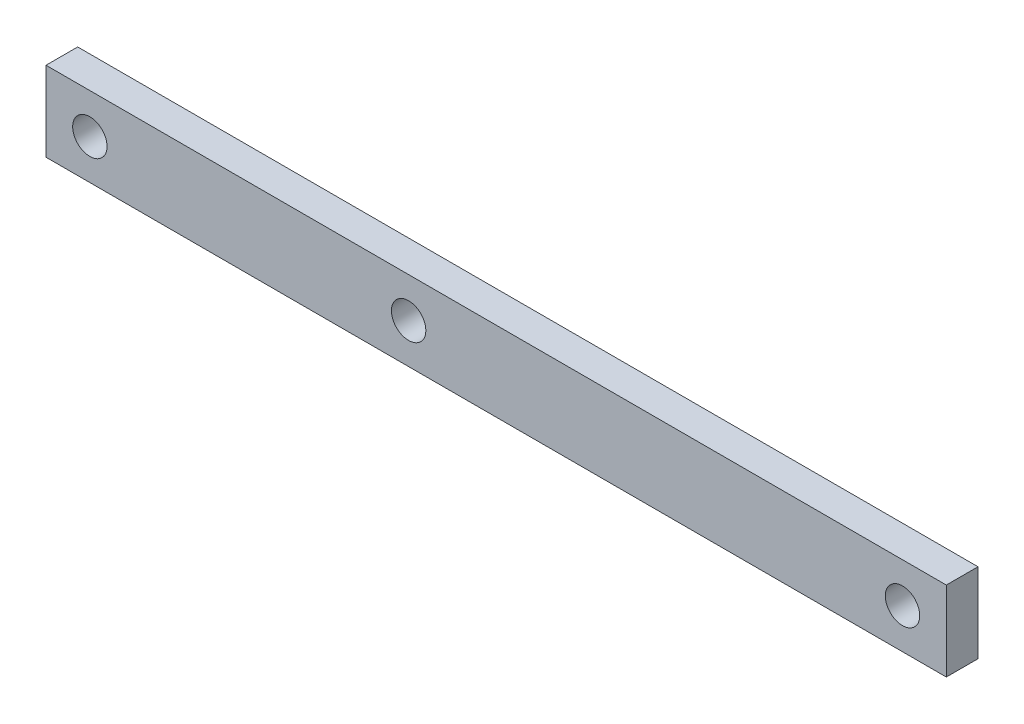
ISO-10303-21;
HEADER;
FILE_DESCRIPTION(('STEP AP214'),'2;1');
FILE_NAME('part.step','',(''),(''),'','','');
FILE_SCHEMA(('AUTOMOTIVE_DESIGN { 1 0 10303 214 1 1 1 1 }'));
ENDSEC;
DATA;
#1=APPLICATION_CONTEXT('core data for automotive mechanical design processes');
#2=APPLICATION_PROTOCOL_DEFINITION('international standard','automotive_design',2000,#1);
#3=PRODUCT_CONTEXT('',#1,'mechanical');
#4=PRODUCT('Part','Part','',(#3));
#5=PRODUCT_RELATED_PRODUCT_CATEGORY('part','',(#4));
#6=PRODUCT_DEFINITION_FORMATION('','',#4);
#7=PRODUCT_DEFINITION_CONTEXT('part definition',#1,'design');
#8=PRODUCT_DEFINITION('design','',#6,#7);
#9=PRODUCT_DEFINITION_SHAPE('','',#8);
#10=(LENGTH_UNIT() NAMED_UNIT(*) SI_UNIT(.MILLI.,.METRE.));
#11=(NAMED_UNIT(*) PLANE_ANGLE_UNIT() SI_UNIT($,.RADIAN.));
#12=(NAMED_UNIT(*) SI_UNIT($,.STERADIAN.) SOLID_ANGLE_UNIT());
#13=UNCERTAINTY_MEASURE_WITH_UNIT(LENGTH_MEASURE(1.E-05),#10,'distance_accuracy_value','');
#14=(GEOMETRIC_REPRESENTATION_CONTEXT(3) GLOBAL_UNCERTAINTY_ASSIGNED_CONTEXT((#13)) GLOBAL_UNIT_ASSIGNED_CONTEXT((#10,
#11,#12)) REPRESENTATION_CONTEXT('',''));
#15=CARTESIAN_POINT('',(0.,0.,0.));
#16=DIRECTION('',(0.,0.,1.));
#17=DIRECTION('',(1.,0.,0.));
#18=AXIS2_PLACEMENT_3D('',#15,#16,#17);
#19=CARTESIAN_POINT('',(0.,0.,3.18));
#20=DIRECTION('',(0.,1.,0.));
#21=DIRECTION('',(0.,0.,1.));
#22=AXIS2_PLACEMENT_3D('',#19,#20,#21);
#23=PLANE('',#22);
#24=DIRECTION('',(1.,0.,0.));
#25=VECTOR('',#24,1.);
#26=CARTESIAN_POINT('',(0.,0.,0.));
#27=LINE('',#26,#25);
#28=CARTESIAN_POINT('',(0.,0.,0.));
#29=VERTEX_POINT('',#28);
#30=CARTESIAN_POINT('',(90.38,0.,0.));
#31=VERTEX_POINT('',#30);
#32=EDGE_CURVE('E98',#29,#31,#27,.T.);
#33=ORIENTED_EDGE('',*,*,#32,.T.);
#34=DIRECTION('',(0.,0.,-1.));
#35=VECTOR('',#34,1.);
#36=CARTESIAN_POINT('',(90.38,0.,3.18));
#37=LINE('',#36,#35);
#38=CARTESIAN_POINT('',(90.38,0.,3.18));
#39=VERTEX_POINT('',#38);
#40=EDGE_CURVE('E11',#39,#31,#37,.T.);
#41=ORIENTED_EDGE('',*,*,#40,.F.);
#42=DIRECTION('',(1.,0.,0.));
#43=VECTOR('',#42,1.);
#44=CARTESIAN_POINT('',(0.,0.,3.18));
#45=LINE('',#44,#43);
#46=CARTESIAN_POINT('',(0.,0.,3.18));
#47=VERTEX_POINT('',#46);
#48=EDGE_CURVE('E84',#47,#39,#45,.T.);
#49=ORIENTED_EDGE('',*,*,#48,.F.);
#50=DIRECTION('',(0.,0.,-1.));
#51=VECTOR('',#50,1.);
#52=CARTESIAN_POINT('',(0.,0.,3.18));
#53=LINE('',#52,#51);
#54=EDGE_CURVE('E51',#47,#29,#53,.T.);
#55=ORIENTED_EDGE('',*,*,#54,.T.);
#56=EDGE_LOOP('',(#33,#41,#49,#55));
#57=FACE_BOUND('',#56,.T.);
#58=ADVANCED_FACE('F35',(#57),#23,.F.);
#59=CARTESIAN_POINT('',(90.38,0.,3.18));
#60=DIRECTION('',(-1.,0.,0.));
#61=DIRECTION('',(0.,0.,1.));
#62=AXIS2_PLACEMENT_3D('',#59,#60,#61);
#63=PLANE('',#62);
#64=DIRECTION('',(0.,1.,0.));
#65=VECTOR('',#64,1.);
#66=CARTESIAN_POINT('',(90.38,0.,0.));
#67=LINE('',#66,#65);
#68=CARTESIAN_POINT('',(90.38,8.,0.));
#69=VERTEX_POINT('',#68);
#70=EDGE_CURVE('E89',#31,#69,#67,.T.);
#71=ORIENTED_EDGE('',*,*,#70,.T.);
#72=DIRECTION('',(0.,0.,-1.));
#73=VECTOR('',#72,1.);
#74=CARTESIAN_POINT('',(90.38,8.,3.18));
#75=LINE('',#74,#73);
#76=CARTESIAN_POINT('',(90.38,8.,3.18));
#77=VERTEX_POINT('',#76);
#78=EDGE_CURVE('E43',#77,#69,#75,.T.);
#79=ORIENTED_EDGE('',*,*,#78,.F.);
#80=DIRECTION('',(0.,1.,0.));
#81=VECTOR('',#80,1.);
#82=CARTESIAN_POINT('',(90.38,0.,3.18));
#83=LINE('',#82,#81);
#84=EDGE_CURVE('E76',#39,#77,#83,.T.);
#85=ORIENTED_EDGE('',*,*,#84,.F.);
#86=ORIENTED_EDGE('',*,*,#40,.T.);
#87=EDGE_LOOP('',(#71,#79,#85,#86));
#88=FACE_BOUND('',#87,.T.);
#89=ADVANCED_FACE('F88',(#88),#63,.F.);
#90=CARTESIAN_POINT('',(0.,8.,3.18));
#91=DIRECTION('',(0.,1.,0.));
#92=DIRECTION('',(0.,0.,1.));
#93=AXIS2_PLACEMENT_3D('',#90,#91,#92);
#94=PLANE('',#93);
#95=DIRECTION('',(1.,0.,0.));
#96=VECTOR('',#95,1.);
#97=CARTESIAN_POINT('',(0.,8.,0.));
#98=LINE('',#97,#96);
#99=CARTESIAN_POINT('',(0.,8.,0.));
#100=VERTEX_POINT('',#99);
#101=EDGE_CURVE('E102',#100,#69,#98,.T.);
#102=ORIENTED_EDGE('',*,*,#101,.F.);
#103=DIRECTION('',(0.,0.,-1.));
#104=VECTOR('',#103,1.);
#105=CARTESIAN_POINT('',(0.,8.,3.18));
#106=LINE('',#105,#104);
#107=CARTESIAN_POINT('',(0.,8.,3.18));
#108=VERTEX_POINT('',#107);
#109=EDGE_CURVE('E65',#108,#100,#106,.T.);
#110=ORIENTED_EDGE('',*,*,#109,.F.);
#111=DIRECTION('',(1.,0.,0.));
#112=VECTOR('',#111,1.);
#113=CARTESIAN_POINT('',(0.,8.,3.18));
#114=LINE('',#113,#112);
#115=EDGE_CURVE('E83',#108,#77,#114,.T.);
#116=ORIENTED_EDGE('',*,*,#115,.T.);
#117=ORIENTED_EDGE('',*,*,#78,.T.);
#118=EDGE_LOOP('',(#102,#110,#116,#117));
#119=FACE_BOUND('',#118,.T.);
#120=ADVANCED_FACE('F92',(#119),#94,.T.);
#121=CARTESIAN_POINT('',(0.,0.,3.18));
#122=DIRECTION('',(-1.,0.,0.));
#123=DIRECTION('',(0.,0.,1.));
#124=AXIS2_PLACEMENT_3D('',#121,#122,#123);
#125=PLANE('',#124);
#126=DIRECTION('',(0.,1.,0.));
#127=VECTOR('',#126,1.);
#128=CARTESIAN_POINT('',(0.,0.,0.));
#129=LINE('',#128,#127);
#130=EDGE_CURVE('E104',#29,#100,#129,.T.);
#131=ORIENTED_EDGE('',*,*,#130,.F.);
#132=ORIENTED_EDGE('',*,*,#54,.F.);
#133=DIRECTION('',(0.,1.,0.));
#134=VECTOR('',#133,1.);
#135=CARTESIAN_POINT('',(0.,0.,3.18));
#136=LINE('',#135,#134);
#137=EDGE_CURVE('E93',#47,#108,#136,.T.);
#138=ORIENTED_EDGE('',*,*,#137,.T.);
#139=ORIENTED_EDGE('',*,*,#109,.T.);
#140=EDGE_LOOP('',(#131,#132,#138,#139));
#141=FACE_BOUND('',#140,.T.);
#142=ADVANCED_FACE('F140',(#141),#125,.T.);
#143=CARTESIAN_POINT('',(0.,0.,3.18));
#144=DIRECTION('',(0.,0.,1.));
#145=DIRECTION('',(1.,0.,0.));
#146=AXIS2_PLACEMENT_3D('',#143,#144,#145);
#147=PLANE('',#146);
#148=CARTESIAN_POINT('',(85.9823578164669,4.,3.18));
#149=DIRECTION('',(0.,0.,1.));
#150=DIRECTION('',(1.,0.,0.));
#151=AXIS2_PLACEMENT_3D('',#148,#149,#150);
#152=CIRCLE('',#151,1.7272);
#153=CARTESIAN_POINT('',(87.7095578164669,4.,3.18));
#154=VERTEX_POINT('',#153);
#155=EDGE_CURVE('E122',#154,#154,#152,.T.);
#156=ORIENTED_EDGE('',*,*,#155,.F.);
#157=EDGE_LOOP('',(#156));
#158=FACE_BOUND('',#157,.T.);
#159=CARTESIAN_POINT('',(36.4023578164669,4.,3.18));
#160=DIRECTION('',(0.,0.,1.));
#161=DIRECTION('',(1.,0.,0.));
#162=AXIS2_PLACEMENT_3D('',#159,#160,#161);
#163=CIRCLE('',#162,1.7272);
#164=CARTESIAN_POINT('',(38.1295578164669,4.,3.18));
#165=VERTEX_POINT('',#164);
#166=EDGE_CURVE('E116',#165,#165,#163,.T.);
#167=ORIENTED_EDGE('',*,*,#166,.F.);
#168=EDGE_LOOP('',(#167));
#169=FACE_BOUND('',#168,.T.);
#170=CARTESIAN_POINT('',(4.40235781646692,4.,3.18));
#171=DIRECTION('',(0.,0.,1.));
#172=DIRECTION('',(1.,0.,0.));
#173=AXIS2_PLACEMENT_3D('',#170,#171,#172);
#174=CIRCLE('',#173,1.7272);
#175=CARTESIAN_POINT('',(6.12955781646692,4.,3.18));
#176=VERTEX_POINT('',#175);
#177=EDGE_CURVE('E110',#176,#176,#174,.T.);
#178=ORIENTED_EDGE('',*,*,#177,.F.);
#179=EDGE_LOOP('',(#178));
#180=FACE_BOUND('',#179,.T.);
#181=ORIENTED_EDGE('',*,*,#48,.T.);
#182=ORIENTED_EDGE('',*,*,#84,.T.);
#183=ORIENTED_EDGE('',*,*,#115,.F.);
#184=ORIENTED_EDGE('',*,*,#137,.F.);
#185=EDGE_LOOP('',(#181,#182,#183,#184));
#186=FACE_BOUND('',#185,.T.);
#187=ADVANCED_FACE('F80',(#158,#169,#180,#186),#147,.T.);
#188=CARTESIAN_POINT('',(0.,0.,0.));
#189=DIRECTION('',(0.,0.,1.));
#190=DIRECTION('',(1.,0.,0.));
#191=AXIS2_PLACEMENT_3D('',#188,#189,#190);
#192=PLANE('',#191);
#193=CARTESIAN_POINT('',(85.9823578164669,4.,0.));
#194=DIRECTION('',(0.,0.,1.));
#195=DIRECTION('',(1.,0.,0.));
#196=AXIS2_PLACEMENT_3D('',#193,#194,#195);
#197=CIRCLE('',#196,1.7272);
#198=CARTESIAN_POINT('',(87.7095578164669,4.,0.));
#199=VERTEX_POINT('',#198);
#200=EDGE_CURVE('E119',#199,#199,#197,.T.);
#201=ORIENTED_EDGE('',*,*,#200,.T.);
#202=EDGE_LOOP('',(#201));
#203=FACE_BOUND('',#202,.T.);
#204=CARTESIAN_POINT('',(36.4023578164669,4.,0.));
#205=DIRECTION('',(0.,0.,1.));
#206=DIRECTION('',(1.,0.,0.));
#207=AXIS2_PLACEMENT_3D('',#204,#205,#206);
#208=CIRCLE('',#207,1.7272);
#209=CARTESIAN_POINT('',(38.1295578164669,4.,0.));
#210=VERTEX_POINT('',#209);
#211=EDGE_CURVE('E113',#210,#210,#208,.T.);
#212=ORIENTED_EDGE('',*,*,#211,.T.);
#213=EDGE_LOOP('',(#212));
#214=FACE_BOUND('',#213,.T.);
#215=CARTESIAN_POINT('',(4.40235781646692,4.,0.));
#216=DIRECTION('',(0.,0.,1.));
#217=DIRECTION('',(1.,0.,0.));
#218=AXIS2_PLACEMENT_3D('',#215,#216,#217);
#219=CIRCLE('',#218,1.7272);
#220=CARTESIAN_POINT('',(6.12955781646692,4.,0.));
#221=VERTEX_POINT('',#220);
#222=EDGE_CURVE('E100',#221,#221,#219,.T.);
#223=ORIENTED_EDGE('',*,*,#222,.T.);
#224=EDGE_LOOP('',(#223));
#225=FACE_BOUND('',#224,.T.);
#226=ORIENTED_EDGE('',*,*,#32,.F.);
#227=ORIENTED_EDGE('',*,*,#130,.T.);
#228=ORIENTED_EDGE('',*,*,#101,.T.);
#229=ORIENTED_EDGE('',*,*,#70,.F.);
#230=EDGE_LOOP('',(#226,#227,#228,#229));
#231=FACE_BOUND('',#230,.T.);
#232=ADVANCED_FACE('F128',(#203,#214,#225,#231),#192,.F.);
#233=CARTESIAN_POINT('',(4.40235781646692,4.,0.));
#234=DIRECTION('',(0.,0.,1.));
#235=DIRECTION('',(1.,0.,0.));
#236=AXIS2_PLACEMENT_3D('',#233,#234,#235);
#237=CYLINDRICAL_SURFACE('',#236,1.7272);
#238=ORIENTED_EDGE('',*,*,#222,.F.);
#239=EDGE_LOOP('',(#238));
#240=FACE_BOUND('',#239,.T.);
#241=ORIENTED_EDGE('',*,*,#177,.T.);
#242=EDGE_LOOP('',(#241));
#243=FACE_BOUND('',#242,.T.);
#244=ADVANCED_FACE('F146',(#240,#243),#237,.F.);
#245=CARTESIAN_POINT('',(36.4023578164669,4.,0.));
#246=DIRECTION('',(0.,0.,1.));
#247=DIRECTION('',(1.,0.,0.));
#248=AXIS2_PLACEMENT_3D('',#245,#246,#247);
#249=CYLINDRICAL_SURFACE('',#248,1.7272);
#250=ORIENTED_EDGE('',*,*,#211,.F.);
#251=EDGE_LOOP('',(#250));
#252=FACE_BOUND('',#251,.T.);
#253=ORIENTED_EDGE('',*,*,#166,.T.);
#254=EDGE_LOOP('',(#253));
#255=FACE_BOUND('',#254,.T.);
#256=ADVANCED_FACE('F134',(#252,#255),#249,.F.);
#257=CARTESIAN_POINT('',(85.9823578164669,4.,0.));
#258=DIRECTION('',(0.,0.,1.));
#259=DIRECTION('',(1.,0.,0.));
#260=AXIS2_PLACEMENT_3D('',#257,#258,#259);
#261=CYLINDRICAL_SURFACE('',#260,1.7272);
#262=ORIENTED_EDGE('',*,*,#200,.F.);
#263=EDGE_LOOP('',(#262));
#264=FACE_BOUND('',#263,.T.);
#265=ORIENTED_EDGE('',*,*,#155,.T.);
#266=EDGE_LOOP('',(#265));
#267=FACE_BOUND('',#266,.T.);
#268=ADVANCED_FACE('F131',(#264,#267),#261,.F.);
#269=CLOSED_SHELL('',(#58,#89,#120,#142,#187,#232,#244,#256,#268));
#270=MANIFOLD_SOLID_BREP('B2',#269);
#271=ADVANCED_BREP_SHAPE_REPRESENTATION('',(#18,#270),#14);
#272=SHAPE_DEFINITION_REPRESENTATION(#9,#271);
ENDSEC;
END-ISO-10303-21;
